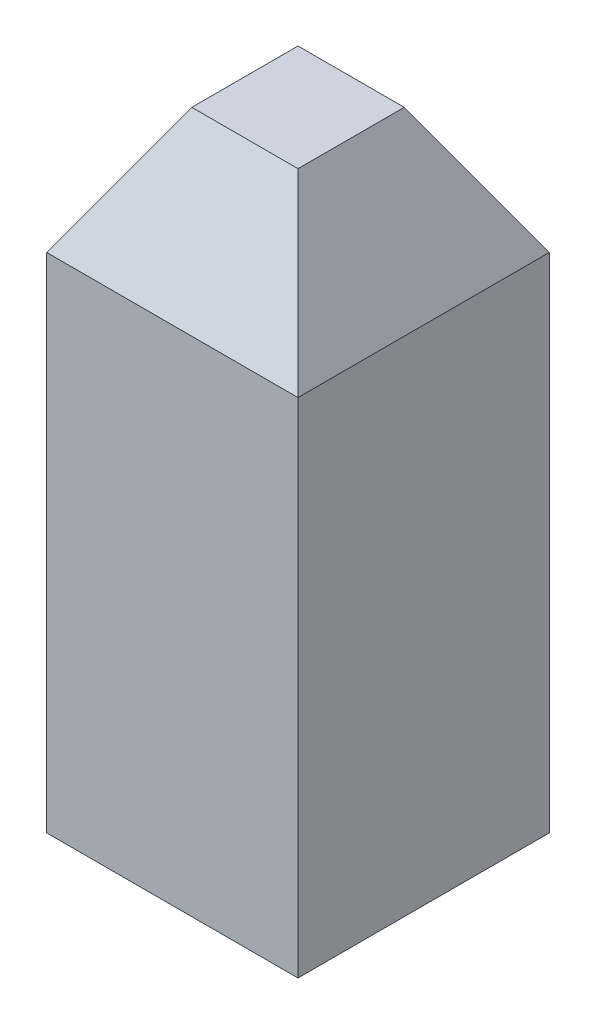
ISO-10303-21;
HEADER;
FILE_DESCRIPTION(('STEP AP214'),'2;1');
FILE_NAME('part.step','',(''),(''),'','','');
FILE_SCHEMA(('AUTOMOTIVE_DESIGN { 1 0 10303 214 1 1 1 1 }'));
ENDSEC;
DATA;
#1=APPLICATION_CONTEXT('core data for automotive mechanical design processes');
#2=APPLICATION_PROTOCOL_DEFINITION('international standard','automotive_design',2000,#1);
#3=PRODUCT_CONTEXT('',#1,'mechanical');
#4=PRODUCT('Part','Part','',(#3));
#5=PRODUCT_RELATED_PRODUCT_CATEGORY('part','',(#4));
#6=PRODUCT_DEFINITION_FORMATION('','',#4);
#7=PRODUCT_DEFINITION_CONTEXT('part definition',#1,'design');
#8=PRODUCT_DEFINITION('design','',#6,#7);
#9=PRODUCT_DEFINITION_SHAPE('','',#8);
#10=(LENGTH_UNIT() NAMED_UNIT(*) SI_UNIT(.MILLI.,.METRE.));
#11=(NAMED_UNIT(*) PLANE_ANGLE_UNIT() SI_UNIT($,.RADIAN.));
#12=(NAMED_UNIT(*) SI_UNIT($,.STERADIAN.) SOLID_ANGLE_UNIT());
#13=UNCERTAINTY_MEASURE_WITH_UNIT(LENGTH_MEASURE(1.E-05),#10,'distance_accuracy_value','');
#14=(GEOMETRIC_REPRESENTATION_CONTEXT(3) GLOBAL_UNCERTAINTY_ASSIGNED_CONTEXT((#13)) GLOBAL_UNIT_ASSIGNED_CONTEXT((#10,
#11,#12)) REPRESENTATION_CONTEXT('',''));
#15=CARTESIAN_POINT('',(0.,0.,0.));
#16=DIRECTION('',(0.,0.,1.));
#17=DIRECTION('',(1.,0.,0.));
#18=AXIS2_PLACEMENT_3D('',#15,#16,#17);
#19=CARTESIAN_POINT('',(0.25,0.5,0.25));
#20=DIRECTION('',(-1.,0.,0.));
#21=DIRECTION('',(0.,0.,1.));
#22=AXIS2_PLACEMENT_3D('',#19,#20,#21);
#23=PLANE('',#22);
#24=DIRECTION('',(0.,0.,-1.));
#25=VECTOR('',#24,1.);
#26=CARTESIAN_POINT('',(0.25,-0.5,0.25));
#27=LINE('',#26,#25);
#28=CARTESIAN_POINT('',(0.25,-0.5,0.25));
#29=VERTEX_POINT('',#28);
#30=CARTESIAN_POINT('',(0.25,-0.5,-0.25));
#31=VERTEX_POINT('',#30);
#32=EDGE_CURVE('E113',#29,#31,#27,.T.);
#33=ORIENTED_EDGE('',*,*,#32,.T.);
#34=DIRECTION('',(0.,-1.,0.));
#35=VECTOR('',#34,1.);
#36=CARTESIAN_POINT('',(0.25,0.5,-0.25));
#37=LINE('',#36,#35);
#38=CARTESIAN_POINT('',(0.25,0.5,-0.25));
#39=VERTEX_POINT('',#38);
#40=EDGE_CURVE('E11',#39,#31,#37,.T.);
#41=ORIENTED_EDGE('',*,*,#40,.F.);
#42=DIRECTION('',(0.,0.,-1.));
#43=VECTOR('',#42,1.);
#44=CARTESIAN_POINT('',(0.25,0.5,0.25));
#45=LINE('',#44,#43);
#46=CARTESIAN_POINT('',(0.25,0.5,0.25));
#47=VERTEX_POINT('',#46);
#48=EDGE_CURVE('E92',#47,#39,#45,.T.);
#49=ORIENTED_EDGE('',*,*,#48,.F.);
#50=DIRECTION('',(0.,-1.,0.));
#51=VECTOR('',#50,1.);
#52=CARTESIAN_POINT('',(0.25,0.5,0.25));
#53=LINE('',#52,#51);
#54=EDGE_CURVE('E94',#47,#29,#53,.T.);
#55=ORIENTED_EDGE('',*,*,#54,.T.);
#56=EDGE_LOOP('',(#33,#41,#49,#55));
#57=FACE_BOUND('',#56,.T.);
#58=ADVANCED_FACE('F32',(#57),#23,.F.);
#59=CARTESIAN_POINT('',(-0.25,0.5,-0.25));
#60=DIRECTION('',(0.,0.,1.));
#61=DIRECTION('',(1.,0.,0.));
#62=AXIS2_PLACEMENT_3D('',#59,#60,#61);
#63=PLANE('',#62);
#64=DIRECTION('',(-1.,0.,0.));
#65=VECTOR('',#64,1.);
#66=CARTESIAN_POINT('',(-0.25,-0.5,-0.25));
#67=LINE('',#66,#65);
#68=CARTESIAN_POINT('',(-0.25,-0.5,-0.25));
#69=VERTEX_POINT('',#68);
#70=EDGE_CURVE('E126',#31,#69,#67,.T.);
#71=ORIENTED_EDGE('',*,*,#70,.T.);
#72=DIRECTION('',(0.,-1.,0.));
#73=VECTOR('',#72,1.);
#74=CARTESIAN_POINT('',(-0.25,0.5,-0.25));
#75=LINE('',#74,#73);
#76=CARTESIAN_POINT('',(-0.25,0.5,-0.25));
#77=VERTEX_POINT('',#76);
#78=EDGE_CURVE('E40',#77,#69,#75,.T.);
#79=ORIENTED_EDGE('',*,*,#78,.F.);
#80=DIRECTION('',(-1.,0.,0.));
#81=VECTOR('',#80,1.);
#82=CARTESIAN_POINT('',(-0.25,0.5,-0.25));
#83=LINE('',#82,#81);
#84=EDGE_CURVE('E74',#39,#77,#83,.T.);
#85=ORIENTED_EDGE('',*,*,#84,.F.);
#86=ORIENTED_EDGE('',*,*,#40,.T.);
#87=EDGE_LOOP('',(#71,#79,#85,#86));
#88=FACE_BOUND('',#87,.T.);
#89=ADVANCED_FACE('F133',(#88),#63,.F.);
#90=CARTESIAN_POINT('',(-0.25,0.5,0.25));
#91=DIRECTION('',(1.,0.,0.));
#92=DIRECTION('',(0.,0.,-1.));
#93=AXIS2_PLACEMENT_3D('',#90,#91,#92);
#94=PLANE('',#93);
#95=DIRECTION('',(0.,0.,1.));
#96=VECTOR('',#95,1.);
#97=CARTESIAN_POINT('',(-0.25,-0.5,0.25));
#98=LINE('',#97,#96);
#99=CARTESIAN_POINT('',(-0.25,-0.5,0.25));
#100=VERTEX_POINT('',#99);
#101=EDGE_CURVE('E64',#69,#100,#98,.T.);
#102=ORIENTED_EDGE('',*,*,#101,.T.);
#103=DIRECTION('',(0.,-1.,0.));
#104=VECTOR('',#103,1.);
#105=CARTESIAN_POINT('',(-0.25,0.5,0.25));
#106=LINE('',#105,#104);
#107=CARTESIAN_POINT('',(-0.25,0.5,0.25));
#108=VERTEX_POINT('',#107);
#109=EDGE_CURVE('E48',#108,#100,#106,.T.);
#110=ORIENTED_EDGE('',*,*,#109,.F.);
#111=DIRECTION('',(0.,0.,1.));
#112=VECTOR('',#111,1.);
#113=CARTESIAN_POINT('',(-0.25,0.5,0.25));
#114=LINE('',#113,#112);
#115=EDGE_CURVE('E120',#77,#108,#114,.T.);
#116=ORIENTED_EDGE('',*,*,#115,.F.);
#117=ORIENTED_EDGE('',*,*,#78,.T.);
#118=EDGE_LOOP('',(#102,#110,#116,#117));
#119=FACE_BOUND('',#118,.T.);
#120=ADVANCED_FACE('F130',(#119),#94,.F.);
#121=CARTESIAN_POINT('',(-0.25,0.5,0.25));
#122=DIRECTION('',(0.,0.,-1.));
#123=DIRECTION('',(-1.,0.,0.));
#124=AXIS2_PLACEMENT_3D('',#121,#122,#123);
#125=PLANE('',#124);
#126=DIRECTION('',(1.,0.,0.));
#127=VECTOR('',#126,1.);
#128=CARTESIAN_POINT('',(-0.25,-0.5,0.25));
#129=LINE('',#128,#127);
#130=EDGE_CURVE('E69',#100,#29,#129,.T.);
#131=ORIENTED_EDGE('',*,*,#130,.T.);
#132=ORIENTED_EDGE('',*,*,#54,.F.);
#133=DIRECTION('',(1.,0.,0.));
#134=VECTOR('',#133,1.);
#135=CARTESIAN_POINT('',(-0.25,0.5,0.25));
#136=LINE('',#135,#134);
#137=EDGE_CURVE('E103',#108,#47,#136,.T.);
#138=ORIENTED_EDGE('',*,*,#137,.F.);
#139=ORIENTED_EDGE('',*,*,#109,.T.);
#140=EDGE_LOOP('',(#131,#132,#138,#139));
#141=FACE_BOUND('',#140,.T.);
#142=ADVANCED_FACE('F101',(#141),#125,.F.);
#143=CARTESIAN_POINT('',(0.,-0.5,0.));
#144=DIRECTION('',(0.,-1.,0.));
#145=DIRECTION('',(0.,0.,-1.));
#146=AXIS2_PLACEMENT_3D('',#143,#144,#145);
#147=PLANE('',#146);
#148=ORIENTED_EDGE('',*,*,#32,.F.);
#149=ORIENTED_EDGE('',*,*,#130,.F.);
#150=ORIENTED_EDGE('',*,*,#101,.F.);
#151=ORIENTED_EDGE('',*,*,#70,.F.);
#152=EDGE_LOOP('',(#148,#149,#150,#151));
#153=FACE_BOUND('',#152,.T.);
#154=ADVANCED_FACE('F132',(#153),#147,.T.);
#155=CARTESIAN_POINT('',(-0.25,0.5,0.25));
#156=DIRECTION('',(0.,0.5,0.866025403784438));
#157=DIRECTION('',(0.,-0.866025403784438,0.5));
#158=AXIS2_PLACEMENT_3D('',#155,#156,#157);
#159=PLANE('',#158);
#160=ORIENTED_EDGE('',*,*,#137,.T.);
#161=DIRECTION('',(0.447213595499958,-0.774596669241483,0.447213595499958));
#162=VECTOR('',#161,1.);
#163=CARTESIAN_POINT('',(0.25,0.5,0.25));
#164=LINE('',#163,#162);
#165=CARTESIAN_POINT('',(0.105662432702593,0.75,0.105662432702593));
#166=VERTEX_POINT('',#165);
#167=EDGE_CURVE('E107',#166,#47,#164,.T.);
#168=ORIENTED_EDGE('',*,*,#167,.F.);
#169=DIRECTION('',(-1.,0.,0.));
#170=VECTOR('',#169,1.);
#171=CARTESIAN_POINT('',(-0.25,0.75,0.105662432702593));
#172=LINE('',#171,#170);
#173=CARTESIAN_POINT('',(-0.105662432702593,0.75,0.105662432702593));
#174=VERTEX_POINT('',#173);
#175=EDGE_CURVE('E162',#174,#166,#172,.F.);
#176=ORIENTED_EDGE('',*,*,#175,.F.);
#177=DIRECTION('',(-0.447213595499958,-0.774596669241483,0.447213595499958));
#178=VECTOR('',#177,1.);
#179=CARTESIAN_POINT('',(-0.25,0.5,0.25));
#180=LINE('',#179,#178);
#181=EDGE_CURVE('E119',#174,#108,#180,.T.);
#182=ORIENTED_EDGE('',*,*,#181,.T.);
#183=EDGE_LOOP('',(#160,#168,#176,#182));
#184=FACE_BOUND('',#183,.T.);
#185=ADVANCED_FACE('F117',(#184),#159,.T.);
#186=CARTESIAN_POINT('',(0.25,0.5,0.25));
#187=DIRECTION('',(0.866025403784438,0.5,0.));
#188=DIRECTION('',(-0.5,0.866025403784438,0.));
#189=AXIS2_PLACEMENT_3D('',#186,#187,#188);
#190=PLANE('',#189);
#191=ORIENTED_EDGE('',*,*,#48,.T.);
#192=DIRECTION('',(0.447213595499958,-0.774596669241483,-0.447213595499958));
#193=VECTOR('',#192,1.);
#194=CARTESIAN_POINT('',(0.25,0.5,-0.25));
#195=LINE('',#194,#193);
#196=CARTESIAN_POINT('',(0.105662432702593,0.75,-0.105662432702593));
#197=VERTEX_POINT('',#196);
#198=EDGE_CURVE('E114',#197,#39,#195,.T.);
#199=ORIENTED_EDGE('',*,*,#198,.F.);
#200=DIRECTION('',(0.,0.,1.));
#201=VECTOR('',#200,1.);
#202=CARTESIAN_POINT('',(0.105662432702593,0.75,0.25));
#203=LINE('',#202,#201);
#204=EDGE_CURVE('E109',#166,#197,#203,.F.);
#205=ORIENTED_EDGE('',*,*,#204,.F.);
#206=ORIENTED_EDGE('',*,*,#167,.T.);
#207=EDGE_LOOP('',(#191,#199,#205,#206));
#208=FACE_BOUND('',#207,.T.);
#209=ADVANCED_FACE('F108',(#208),#190,.T.);
#210=CARTESIAN_POINT('',(0.25,0.5,-0.25));
#211=DIRECTION('',(0.,0.5,-0.866025403784438));
#212=DIRECTION('',(0.,0.866025403784438,0.5));
#213=AXIS2_PLACEMENT_3D('',#210,#211,#212);
#214=PLANE('',#213);
#215=ORIENTED_EDGE('',*,*,#84,.T.);
#216=DIRECTION('',(-0.447213595499958,-0.774596669241483,-0.447213595499958));
#217=VECTOR('',#216,1.);
#218=CARTESIAN_POINT('',(-0.25,0.5,-0.25));
#219=LINE('',#218,#217);
#220=CARTESIAN_POINT('',(-0.105662432702593,0.75,-0.105662432702593));
#221=VERTEX_POINT('',#220);
#222=EDGE_CURVE('E175',#221,#77,#219,.T.);
#223=ORIENTED_EDGE('',*,*,#222,.F.);
#224=DIRECTION('',(1.,0.,0.));
#225=VECTOR('',#224,1.);
#226=CARTESIAN_POINT('',(0.25,0.75,-0.105662432702593));
#227=LINE('',#226,#225);
#228=EDGE_CURVE('E166',#197,#221,#227,.F.);
#229=ORIENTED_EDGE('',*,*,#228,.F.);
#230=ORIENTED_EDGE('',*,*,#198,.T.);
#231=EDGE_LOOP('',(#215,#223,#229,#230));
#232=FACE_BOUND('',#231,.T.);
#233=ADVANCED_FACE('F147',(#232),#214,.T.);
#234=CARTESIAN_POINT('',(-0.25,0.5,-0.25));
#235=DIRECTION('',(-0.866025403784438,0.5,0.));
#236=DIRECTION('',(-0.5,-0.866025403784438,0.));
#237=AXIS2_PLACEMENT_3D('',#234,#235,#236);
#238=PLANE('',#237);
#239=ORIENTED_EDGE('',*,*,#115,.T.);
#240=ORIENTED_EDGE('',*,*,#181,.F.);
#241=DIRECTION('',(0.,0.,-1.));
#242=VECTOR('',#241,1.);
#243=CARTESIAN_POINT('',(-0.105662432702593,0.75,-0.25));
#244=LINE('',#243,#242);
#245=EDGE_CURVE('E164',#221,#174,#244,.F.);
#246=ORIENTED_EDGE('',*,*,#245,.F.);
#247=ORIENTED_EDGE('',*,*,#222,.T.);
#248=EDGE_LOOP('',(#239,#240,#246,#247));
#249=FACE_BOUND('',#248,.T.);
#250=ADVANCED_FACE('F150',(#249),#238,.T.);
#251=CARTESIAN_POINT('',(0.,0.75,0.));
#252=DIRECTION('',(0.,1.,0.));
#253=DIRECTION('',(0.,0.,1.));
#254=AXIS2_PLACEMENT_3D('',#251,#252,#253);
#255=PLANE('',#254);
#256=ORIENTED_EDGE('',*,*,#175,.T.);
#257=ORIENTED_EDGE('',*,*,#204,.T.);
#258=ORIENTED_EDGE('',*,*,#228,.T.);
#259=ORIENTED_EDGE('',*,*,#245,.T.);
#260=EDGE_LOOP('',(#256,#257,#258,#259));
#261=FACE_BOUND('',#260,.T.);
#262=ADVANCED_FACE('F154',(#261),#255,.T.);
#263=CLOSED_SHELL('',(#58,#89,#120,#142,#154,#185,#209,#233,#250,#262));
#264=MANIFOLD_SOLID_BREP('B2',#263);
#265=ADVANCED_BREP_SHAPE_REPRESENTATION('',(#18,#264),#14);
#266=SHAPE_DEFINITION_REPRESENTATION(#9,#265);
ENDSEC;
END-ISO-10303-21;
